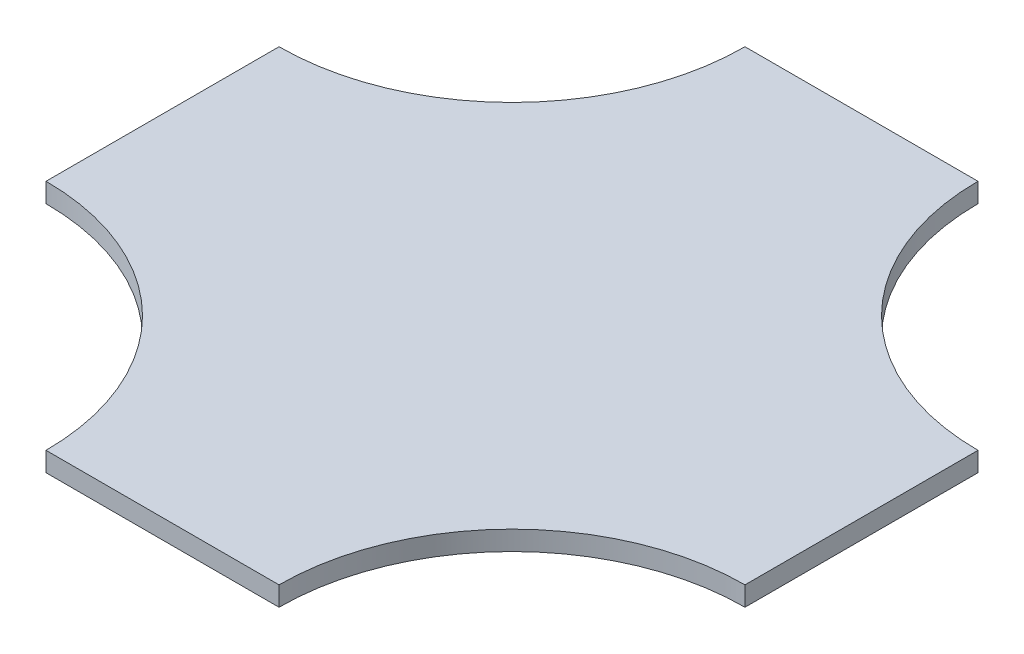
ISO-10303-21;
HEADER;
FILE_DESCRIPTION(('STEP AP214'),'2;1');
FILE_NAME('part.step','',(''),(''),'','','');
FILE_SCHEMA(('AUTOMOTIVE_DESIGN { 1 0 10303 214 1 1 1 1 }'));
ENDSEC;
DATA;
#1=APPLICATION_CONTEXT('core data for automotive mechanical design processes');
#2=APPLICATION_PROTOCOL_DEFINITION('international standard','automotive_design',2000,#1);
#3=PRODUCT_CONTEXT('',#1,'mechanical');
#4=PRODUCT('Part','Part','',(#3));
#5=PRODUCT_RELATED_PRODUCT_CATEGORY('part','',(#4));
#6=PRODUCT_DEFINITION_FORMATION('','',#4);
#7=PRODUCT_DEFINITION_CONTEXT('part definition',#1,'design');
#8=PRODUCT_DEFINITION('design','',#6,#7);
#9=PRODUCT_DEFINITION_SHAPE('','',#8);
#10=(LENGTH_UNIT() NAMED_UNIT(*) SI_UNIT(.MILLI.,.METRE.));
#11=(NAMED_UNIT(*) PLANE_ANGLE_UNIT() SI_UNIT($,.RADIAN.));
#12=(NAMED_UNIT(*) SI_UNIT($,.STERADIAN.) SOLID_ANGLE_UNIT());
#13=UNCERTAINTY_MEASURE_WITH_UNIT(LENGTH_MEASURE(1.E-05),#10,'distance_accuracy_value','');
#14=(GEOMETRIC_REPRESENTATION_CONTEXT(3) GLOBAL_UNCERTAINTY_ASSIGNED_CONTEXT((#13)) GLOBAL_UNIT_ASSIGNED_CONTEXT((#10,
#11,#12)) REPRESENTATION_CONTEXT('',''));
#15=CARTESIAN_POINT('',(0.,0.,0.));
#16=DIRECTION('',(0.,0.,1.));
#17=DIRECTION('',(1.,0.,0.));
#18=AXIS2_PLACEMENT_3D('',#15,#16,#17);
#19=CARTESIAN_POINT('',(0.,10.,180.));
#20=DIRECTION('',(0.,0.,1.));
#21=DIRECTION('',(1.,0.,0.));
#22=AXIS2_PLACEMENT_3D('',#19,#20,#21);
#23=PLANE('',#22);
#24=DIRECTION('',(-1.,0.,0.));
#25=VECTOR('',#24,1.);
#26=CARTESIAN_POINT('',(0.,0.,180.));
#27=LINE('',#26,#25);
#28=CARTESIAN_POINT('',(60.,0.,180.));
#29=VERTEX_POINT('',#28);
#30=CARTESIAN_POINT('',(-59.9999999999999,0.,180.));
#31=VERTEX_POINT('',#30);
#32=EDGE_CURVE('E128',#29,#31,#27,.T.);
#33=ORIENTED_EDGE('',*,*,#32,.F.);
#34=DIRECTION('',(0.,-1.,0.));
#35=VECTOR('',#34,1.);
#36=CARTESIAN_POINT('',(60.,10.,180.));
#37=LINE('',#36,#35);
#38=CARTESIAN_POINT('',(60.,10.,180.));
#39=VERTEX_POINT('',#38);
#40=EDGE_CURVE('E11',#39,#29,#37,.T.);
#41=ORIENTED_EDGE('',*,*,#40,.F.);
#42=DIRECTION('',(-1.,0.,0.));
#43=VECTOR('',#42,1.);
#44=CARTESIAN_POINT('',(0.,10.,180.));
#45=LINE('',#44,#43);
#46=CARTESIAN_POINT('',(-59.9999999999999,10.,180.));
#47=VERTEX_POINT('',#46);
#48=EDGE_CURVE('E146',#39,#47,#45,.T.);
#49=ORIENTED_EDGE('',*,*,#48,.T.);
#50=DIRECTION('',(0.,-1.,0.));
#51=VECTOR('',#50,1.);
#52=CARTESIAN_POINT('',(-59.9999999999999,10.,180.));
#53=LINE('',#52,#51);
#54=EDGE_CURVE('E86',#47,#31,#53,.T.);
#55=ORIENTED_EDGE('',*,*,#54,.T.);
#56=EDGE_LOOP('',(#33,#41,#49,#55));
#57=FACE_BOUND('',#56,.T.);
#58=ADVANCED_FACE('F35',(#57),#23,.T.);
#59=CARTESIAN_POINT('',(180.,10.,180.));
#60=DIRECTION('',(0.,-1.,0.));
#61=DIRECTION('',(0.,0.,-1.));
#62=AXIS2_PLACEMENT_3D('',#59,#60,#61);
#63=CYLINDRICAL_SURFACE('',#62,120.);
#64=CARTESIAN_POINT('',(180.,0.,180.));
#65=DIRECTION('',(0.,1.,0.));
#66=DIRECTION('',(0.,0.,1.));
#67=AXIS2_PLACEMENT_3D('',#64,#65,#66);
#68=CIRCLE('',#67,120.);
#69=CARTESIAN_POINT('',(180.,0.,60.0000000000001));
#70=VERTEX_POINT('',#69);
#71=EDGE_CURVE('E131',#70,#29,#68,.T.);
#72=ORIENTED_EDGE('',*,*,#71,.F.);
#73=DIRECTION('',(0.,-1.,0.));
#74=VECTOR('',#73,1.);
#75=CARTESIAN_POINT('',(180.,10.,60.0000000000001));
#76=LINE('',#75,#74);
#77=CARTESIAN_POINT('',(180.,10.,60.0000000000001));
#78=VERTEX_POINT('',#77);
#79=EDGE_CURVE('E43',#78,#70,#76,.T.);
#80=ORIENTED_EDGE('',*,*,#79,.F.);
#81=CARTESIAN_POINT('',(180.,10.,180.));
#82=DIRECTION('',(0.,1.,0.));
#83=DIRECTION('',(0.,0.,1.));
#84=AXIS2_PLACEMENT_3D('',#81,#82,#83);
#85=CIRCLE('',#84,120.);
#86=EDGE_CURVE('E172',#78,#39,#85,.T.);
#87=ORIENTED_EDGE('',*,*,#86,.T.);
#88=ORIENTED_EDGE('',*,*,#40,.T.);
#89=EDGE_LOOP('',(#72,#80,#87,#88));
#90=FACE_BOUND('',#89,.T.);
#91=ADVANCED_FACE('F163',(#90),#63,.F.);
#92=CARTESIAN_POINT('',(180.,10.,0.));
#93=DIRECTION('',(1.,0.,0.));
#94=DIRECTION('',(0.,0.,-1.));
#95=AXIS2_PLACEMENT_3D('',#92,#93,#94);
#96=PLANE('',#95);
#97=DIRECTION('',(0.,0.,1.));
#98=VECTOR('',#97,1.);
#99=CARTESIAN_POINT('',(180.,0.,0.));
#100=LINE('',#99,#98);
#101=CARTESIAN_POINT('',(180.,0.,-59.9999999999998));
#102=VERTEX_POINT('',#101);
#103=EDGE_CURVE('E134',#102,#70,#100,.T.);
#104=ORIENTED_EDGE('',*,*,#103,.F.);
#105=DIRECTION('',(0.,-1.,0.));
#106=VECTOR('',#105,1.);
#107=CARTESIAN_POINT('',(180.,10.,-59.9999999999998));
#108=LINE('',#107,#106);
#109=CARTESIAN_POINT('',(180.,10.,-59.9999999999998));
#110=VERTEX_POINT('',#109);
#111=EDGE_CURVE('E152',#110,#102,#108,.T.);
#112=ORIENTED_EDGE('',*,*,#111,.F.);
#113=DIRECTION('',(0.,0.,1.));
#114=VECTOR('',#113,1.);
#115=CARTESIAN_POINT('',(180.,10.,0.));
#116=LINE('',#115,#114);
#117=EDGE_CURVE('E159',#110,#78,#116,.T.);
#118=ORIENTED_EDGE('',*,*,#117,.T.);
#119=ORIENTED_EDGE('',*,*,#79,.T.);
#120=EDGE_LOOP('',(#104,#112,#118,#119));
#121=FACE_BOUND('',#120,.T.);
#122=ADVANCED_FACE('F157',(#121),#96,.T.);
#123=CARTESIAN_POINT('',(180.,10.,-180.));
#124=DIRECTION('',(0.,-1.,0.));
#125=DIRECTION('',(0.,0.,-1.));
#126=AXIS2_PLACEMENT_3D('',#123,#124,#125);
#127=CYLINDRICAL_SURFACE('',#126,120.);
#128=CARTESIAN_POINT('',(180.,0.,-180.));
#129=DIRECTION('',(0.,1.,0.));
#130=DIRECTION('',(0.,0.,1.));
#131=AXIS2_PLACEMENT_3D('',#128,#129,#130);
#132=CIRCLE('',#131,120.);
#133=CARTESIAN_POINT('',(60.,0.,-180.));
#134=VERTEX_POINT('',#133);
#135=EDGE_CURVE('E137',#134,#102,#132,.T.);
#136=ORIENTED_EDGE('',*,*,#135,.F.);
#137=DIRECTION('',(0.,-1.,0.));
#138=VECTOR('',#137,1.);
#139=CARTESIAN_POINT('',(60.,10.,-180.));
#140=LINE('',#139,#138);
#141=CARTESIAN_POINT('',(60.,10.,-180.));
#142=VERTEX_POINT('',#141);
#143=EDGE_CURVE('E150',#142,#134,#140,.T.);
#144=ORIENTED_EDGE('',*,*,#143,.F.);
#145=CARTESIAN_POINT('',(180.,10.,-180.));
#146=DIRECTION('',(0.,1.,0.));
#147=DIRECTION('',(0.,0.,1.));
#148=AXIS2_PLACEMENT_3D('',#145,#146,#147);
#149=CIRCLE('',#148,120.);
#150=EDGE_CURVE('E171',#142,#110,#149,.T.);
#151=ORIENTED_EDGE('',*,*,#150,.T.);
#152=ORIENTED_EDGE('',*,*,#111,.T.);
#153=EDGE_LOOP('',(#136,#144,#151,#152));
#154=FACE_BOUND('',#153,.T.);
#155=ADVANCED_FACE('F169',(#154),#127,.F.);
#156=CARTESIAN_POINT('',(0.,10.,-180.));
#157=DIRECTION('',(0.,0.,1.));
#158=DIRECTION('',(1.,0.,0.));
#159=AXIS2_PLACEMENT_3D('',#156,#157,#158);
#160=PLANE('',#159);
#161=DIRECTION('',(-1.,0.,0.));
#162=VECTOR('',#161,1.);
#163=CARTESIAN_POINT('',(0.,0.,-180.));
#164=LINE('',#163,#162);
#165=CARTESIAN_POINT('',(-59.9999999999999,0.,-180.));
#166=VERTEX_POINT('',#165);
#167=EDGE_CURVE('E140',#134,#166,#164,.T.);
#168=ORIENTED_EDGE('',*,*,#167,.T.);
#169=DIRECTION('',(0.,-1.,0.));
#170=VECTOR('',#169,1.);
#171=CARTESIAN_POINT('',(-59.9999999999999,10.,-180.));
#172=LINE('',#171,#170);
#173=CARTESIAN_POINT('',(-59.9999999999999,10.,-180.));
#174=VERTEX_POINT('',#173);
#175=EDGE_CURVE('E120',#174,#166,#172,.T.);
#176=ORIENTED_EDGE('',*,*,#175,.F.);
#177=DIRECTION('',(-1.,0.,0.));
#178=VECTOR('',#177,1.);
#179=CARTESIAN_POINT('',(0.,10.,-180.));
#180=LINE('',#179,#178);
#181=EDGE_CURVE('E111',#142,#174,#180,.T.);
#182=ORIENTED_EDGE('',*,*,#181,.F.);
#183=ORIENTED_EDGE('',*,*,#143,.T.);
#184=EDGE_LOOP('',(#168,#176,#182,#183));
#185=FACE_BOUND('',#184,.T.);
#186=ADVANCED_FACE('F188',(#185),#160,.F.);
#187=CARTESIAN_POINT('',(-180.,10.,-180.));
#188=DIRECTION('',(0.,-1.,0.));
#189=DIRECTION('',(0.,0.,-1.));
#190=AXIS2_PLACEMENT_3D('',#187,#188,#189);
#191=CYLINDRICAL_SURFACE('',#190,120.);
#192=CARTESIAN_POINT('',(-180.,0.,-180.));
#193=DIRECTION('',(0.,1.,0.));
#194=DIRECTION('',(0.,0.,1.));
#195=AXIS2_PLACEMENT_3D('',#192,#193,#194);
#196=CIRCLE('',#195,120.);
#197=CARTESIAN_POINT('',(-180.,0.,-59.9999999999998));
#198=VERTEX_POINT('',#197);
#199=EDGE_CURVE('E119',#166,#198,#196,.F.);
#200=ORIENTED_EDGE('',*,*,#199,.T.);
#201=DIRECTION('',(0.,-1.,0.));
#202=VECTOR('',#201,1.);
#203=CARTESIAN_POINT('',(-180.,10.,-59.9999999999998));
#204=LINE('',#203,#202);
#205=CARTESIAN_POINT('',(-180.,10.,-59.9999999999998));
#206=VERTEX_POINT('',#205);
#207=EDGE_CURVE('E116',#206,#198,#204,.T.);
#208=ORIENTED_EDGE('',*,*,#207,.F.);
#209=CARTESIAN_POINT('',(-180.,10.,-180.));
#210=DIRECTION('',(0.,1.,0.));
#211=DIRECTION('',(0.,0.,1.));
#212=AXIS2_PLACEMENT_3D('',#209,#210,#211);
#213=CIRCLE('',#212,120.);
#214=EDGE_CURVE('E104',#174,#206,#213,.F.);
#215=ORIENTED_EDGE('',*,*,#214,.F.);
#216=ORIENTED_EDGE('',*,*,#175,.T.);
#217=EDGE_LOOP('',(#200,#208,#215,#216));
#218=FACE_BOUND('',#217,.T.);
#219=ADVANCED_FACE('F117',(#218),#191,.F.);
#220=CARTESIAN_POINT('',(-180.,10.,0.));
#221=DIRECTION('',(1.,0.,0.));
#222=DIRECTION('',(0.,0.,-1.));
#223=AXIS2_PLACEMENT_3D('',#220,#221,#222);
#224=PLANE('',#223);
#225=DIRECTION('',(0.,0.,1.));
#226=VECTOR('',#225,1.);
#227=CARTESIAN_POINT('',(-180.,0.,0.));
#228=LINE('',#227,#226);
#229=CARTESIAN_POINT('',(-180.,0.,60.0000000000001));
#230=VERTEX_POINT('',#229);
#231=EDGE_CURVE('E79',#198,#230,#228,.T.);
#232=ORIENTED_EDGE('',*,*,#231,.T.);
#233=DIRECTION('',(0.,-1.,0.));
#234=VECTOR('',#233,1.);
#235=CARTESIAN_POINT('',(-180.,10.,60.0000000000001));
#236=LINE('',#235,#234);
#237=CARTESIAN_POINT('',(-180.,10.,60.0000000000001));
#238=VERTEX_POINT('',#237);
#239=EDGE_CURVE('E121',#238,#230,#236,.T.);
#240=ORIENTED_EDGE('',*,*,#239,.F.);
#241=DIRECTION('',(0.,0.,1.));
#242=VECTOR('',#241,1.);
#243=CARTESIAN_POINT('',(-180.,10.,0.));
#244=LINE('',#243,#242);
#245=EDGE_CURVE('E108',#206,#238,#244,.T.);
#246=ORIENTED_EDGE('',*,*,#245,.F.);
#247=ORIENTED_EDGE('',*,*,#207,.T.);
#248=EDGE_LOOP('',(#232,#240,#246,#247));
#249=FACE_BOUND('',#248,.T.);
#250=ADVANCED_FACE('F123',(#249),#224,.F.);
#251=CARTESIAN_POINT('',(-180.,10.,180.));
#252=DIRECTION('',(0.,-1.,0.));
#253=DIRECTION('',(0.,0.,-1.));
#254=AXIS2_PLACEMENT_3D('',#251,#252,#253);
#255=CYLINDRICAL_SURFACE('',#254,120.);
#256=CARTESIAN_POINT('',(-180.,0.,180.));
#257=DIRECTION('',(0.,1.,0.));
#258=DIRECTION('',(0.,0.,1.));
#259=AXIS2_PLACEMENT_3D('',#256,#257,#258);
#260=CIRCLE('',#259,120.);
#261=EDGE_CURVE('E144',#230,#31,#260,.F.);
#262=ORIENTED_EDGE('',*,*,#261,.T.);
#263=ORIENTED_EDGE('',*,*,#54,.F.);
#264=CARTESIAN_POINT('',(-180.,10.,180.));
#265=DIRECTION('',(0.,1.,0.));
#266=DIRECTION('',(0.,0.,1.));
#267=AXIS2_PLACEMENT_3D('',#264,#265,#266);
#268=CIRCLE('',#267,120.);
#269=EDGE_CURVE('E51',#238,#47,#268,.F.);
#270=ORIENTED_EDGE('',*,*,#269,.F.);
#271=ORIENTED_EDGE('',*,*,#239,.T.);
#272=EDGE_LOOP('',(#262,#263,#270,#271));
#273=FACE_BOUND('',#272,.T.);
#274=ADVANCED_FACE('F196',(#273),#255,.F.);
#275=CARTESIAN_POINT('',(0.,10.,0.));
#276=DIRECTION('',(0.,1.,0.));
#277=DIRECTION('',(0.,0.,1.));
#278=AXIS2_PLACEMENT_3D('',#275,#276,#277);
#279=PLANE('',#278);
#280=ORIENTED_EDGE('',*,*,#48,.F.);
#281=ORIENTED_EDGE('',*,*,#86,.F.);
#282=ORIENTED_EDGE('',*,*,#117,.F.);
#283=ORIENTED_EDGE('',*,*,#150,.F.);
#284=ORIENTED_EDGE('',*,*,#181,.T.);
#285=ORIENTED_EDGE('',*,*,#214,.T.);
#286=ORIENTED_EDGE('',*,*,#245,.T.);
#287=ORIENTED_EDGE('',*,*,#269,.T.);
#288=EDGE_LOOP('',(#280,#281,#282,#283,#284,#285,#286,#287));
#289=FACE_BOUND('',#288,.T.);
#290=ADVANCED_FACE('F106',(#289),#279,.T.);
#291=CARTESIAN_POINT('',(0.,0.,0.));
#292=DIRECTION('',(0.,1.,0.));
#293=DIRECTION('',(0.,0.,1.));
#294=AXIS2_PLACEMENT_3D('',#291,#292,#293);
#295=PLANE('',#294);
#296=ORIENTED_EDGE('',*,*,#32,.T.);
#297=ORIENTED_EDGE('',*,*,#261,.F.);
#298=ORIENTED_EDGE('',*,*,#231,.F.);
#299=ORIENTED_EDGE('',*,*,#199,.F.);
#300=ORIENTED_EDGE('',*,*,#167,.F.);
#301=ORIENTED_EDGE('',*,*,#135,.T.);
#302=ORIENTED_EDGE('',*,*,#103,.T.);
#303=ORIENTED_EDGE('',*,*,#71,.T.);
#304=EDGE_LOOP('',(#296,#297,#298,#299,#300,#301,#302,#303));
#305=FACE_BOUND('',#304,.T.);
#306=ADVANCED_FACE('F165',(#305),#295,.F.);
#307=CLOSED_SHELL('',(#58,#91,#122,#155,#186,#219,#250,#274,#290,#306));
#308=MANIFOLD_SOLID_BREP('B2',#307);
#309=ADVANCED_BREP_SHAPE_REPRESENTATION('',(#18,#308),#14);
#310=SHAPE_DEFINITION_REPRESENTATION(#9,#309);
ENDSEC;
END-ISO-10303-21;
